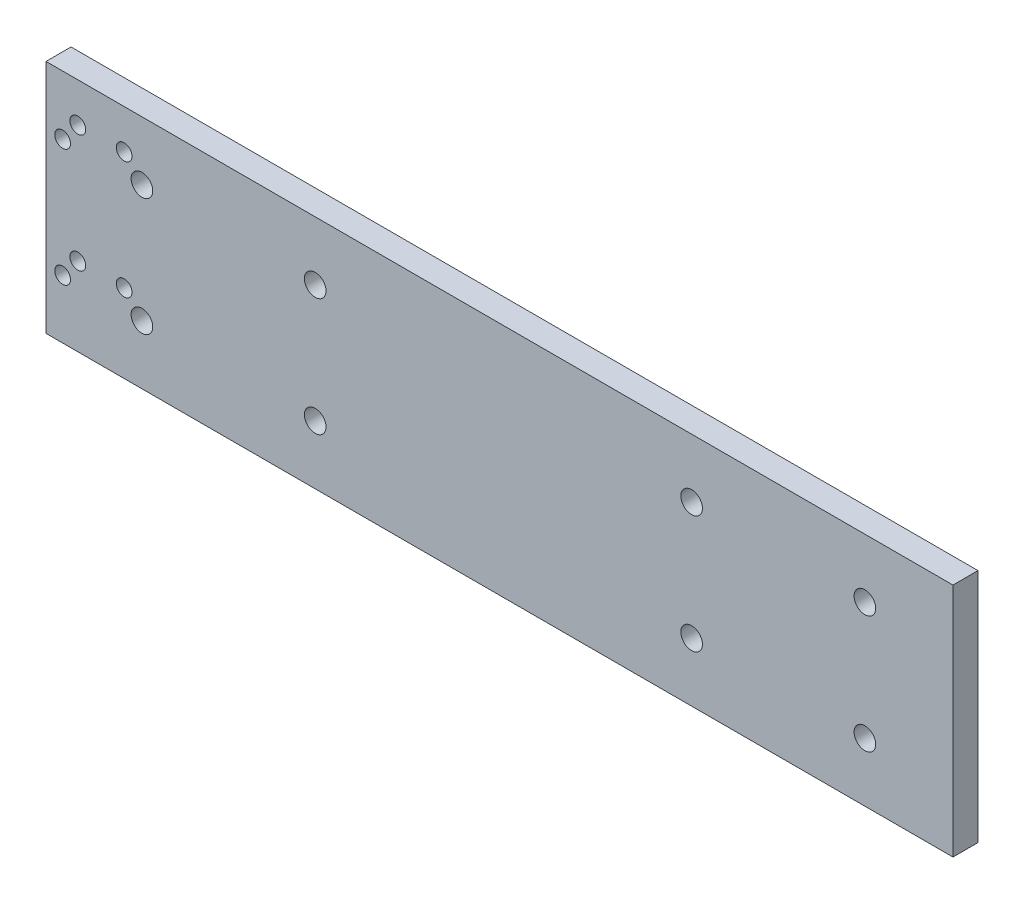
ISO-10303-21;
HEADER;
FILE_DESCRIPTION(('STEP AP214'),'2;1');
FILE_NAME('part.step','',(''),(''),'','','');
FILE_SCHEMA(('AUTOMOTIVE_DESIGN { 1 0 10303 214 1 1 1 1 }'));
ENDSEC;
DATA;
#1=APPLICATION_CONTEXT('core data for automotive mechanical design processes');
#2=APPLICATION_PROTOCOL_DEFINITION('international standard','automotive_design',2000,#1);
#3=PRODUCT_CONTEXT('',#1,'mechanical');
#4=PRODUCT('Part','Part','',(#3));
#5=PRODUCT_RELATED_PRODUCT_CATEGORY('part','',(#4));
#6=PRODUCT_DEFINITION_FORMATION('','',#4);
#7=PRODUCT_DEFINITION_CONTEXT('part definition',#1,'design');
#8=PRODUCT_DEFINITION('design','',#6,#7);
#9=PRODUCT_DEFINITION_SHAPE('','',#8);
#10=(LENGTH_UNIT() NAMED_UNIT(*) SI_UNIT(.MILLI.,.METRE.));
#11=(NAMED_UNIT(*) PLANE_ANGLE_UNIT() SI_UNIT($,.RADIAN.));
#12=(NAMED_UNIT(*) SI_UNIT($,.STERADIAN.) SOLID_ANGLE_UNIT());
#13=UNCERTAINTY_MEASURE_WITH_UNIT(LENGTH_MEASURE(1.E-05),#10,'distance_accuracy_value','');
#14=(GEOMETRIC_REPRESENTATION_CONTEXT(3) GLOBAL_UNCERTAINTY_ASSIGNED_CONTEXT((#13)) GLOBAL_UNIT_ASSIGNED_CONTEXT((#10,
#11,#12)) REPRESENTATION_CONTEXT('',''));
#15=CARTESIAN_POINT('',(0.,0.,0.));
#16=DIRECTION('',(0.,0.,1.));
#17=DIRECTION('',(1.,0.,0.));
#18=AXIS2_PLACEMENT_3D('',#15,#16,#17);
#19=CARTESIAN_POINT('',(34.544,45.72,1.6194));
#20=DIRECTION('',(0.,-1.,0.));
#21=DIRECTION('',(0.,0.,-1.));
#22=AXIS2_PLACEMENT_3D('',#19,#20,#21);
#23=PLANE('',#22);
#24=DIRECTION('',(-1.,0.,0.));
#25=VECTOR('',#24,1.);
#26=CARTESIAN_POINT('',(34.544,45.72,0.));
#27=LINE('',#26,#25);
#28=CARTESIAN_POINT('',(93.218,45.72,0.));
#29=VERTEX_POINT('',#28);
#30=CARTESIAN_POINT('',(34.544,45.72,0.));
#31=VERTEX_POINT('',#30);
#32=EDGE_CURVE('E104',#29,#31,#27,.T.);
#33=ORIENTED_EDGE('',*,*,#32,.T.);
#34=DIRECTION('',(0.,0.,-1.));
#35=VECTOR('',#34,1.);
#36=CARTESIAN_POINT('',(34.544,45.72,1.6194));
#37=LINE('',#36,#35);
#38=CARTESIAN_POINT('',(34.544,45.72,1.6194));
#39=VERTEX_POINT('',#38);
#40=EDGE_CURVE('E11',#39,#31,#37,.T.);
#41=ORIENTED_EDGE('',*,*,#40,.F.);
#42=DIRECTION('',(-1.,0.,0.));
#43=VECTOR('',#42,1.);
#44=CARTESIAN_POINT('',(34.544,45.72,1.6194));
#45=LINE('',#44,#43);
#46=CARTESIAN_POINT('',(93.218,45.72,1.6194));
#47=VERTEX_POINT('',#46);
#48=EDGE_CURVE('E92',#47,#39,#45,.T.);
#49=ORIENTED_EDGE('',*,*,#48,.F.);
#50=DIRECTION('',(0.,0.,-1.));
#51=VECTOR('',#50,1.);
#52=CARTESIAN_POINT('',(93.218,45.72,1.6194));
#53=LINE('',#52,#51);
#54=EDGE_CURVE('E100',#47,#29,#53,.T.);
#55=ORIENTED_EDGE('',*,*,#54,.T.);
#56=EDGE_LOOP('',(#33,#41,#49,#55));
#57=FACE_BOUND('',#56,.T.);
#58=ADVANCED_FACE('F41',(#57),#23,.F.);
#59=CARTESIAN_POINT('',(34.544,30.48,1.6194));
#60=DIRECTION('',(1.,0.,0.));
#61=DIRECTION('',(0.,0.,-1.));
#62=AXIS2_PLACEMENT_3D('',#59,#60,#61);
#63=PLANE('',#62);
#64=DIRECTION('',(0.,-1.,0.));
#65=VECTOR('',#64,1.);
#66=CARTESIAN_POINT('',(34.544,30.48,0.));
#67=LINE('',#66,#65);
#68=CARTESIAN_POINT('',(34.544,30.48,0.));
#69=VERTEX_POINT('',#68);
#70=EDGE_CURVE('E96',#31,#69,#67,.T.);
#71=ORIENTED_EDGE('',*,*,#70,.T.);
#72=DIRECTION('',(0.,0.,-1.));
#73=VECTOR('',#72,1.);
#74=CARTESIAN_POINT('',(34.544,30.48,1.6194));
#75=LINE('',#74,#73);
#76=CARTESIAN_POINT('',(34.544,30.48,1.6194));
#77=VERTEX_POINT('',#76);
#78=EDGE_CURVE('E49',#77,#69,#75,.T.);
#79=ORIENTED_EDGE('',*,*,#78,.F.);
#80=DIRECTION('',(0.,-1.,0.));
#81=VECTOR('',#80,1.);
#82=CARTESIAN_POINT('',(34.544,30.48,1.6194));
#83=LINE('',#82,#81);
#84=EDGE_CURVE('E87',#39,#77,#83,.T.);
#85=ORIENTED_EDGE('',*,*,#84,.F.);
#86=ORIENTED_EDGE('',*,*,#40,.T.);
#87=EDGE_LOOP('',(#71,#79,#85,#86));
#88=FACE_BOUND('',#87,.T.);
#89=ADVANCED_FACE('F95',(#88),#63,.F.);
#90=CARTESIAN_POINT('',(93.218,30.48,1.6194));
#91=DIRECTION('',(0.,1.,0.));
#92=DIRECTION('',(0.,0.,1.));
#93=AXIS2_PLACEMENT_3D('',#90,#91,#92);
#94=PLANE('',#93);
#95=DIRECTION('',(1.,0.,0.));
#96=VECTOR('',#95,1.);
#97=CARTESIAN_POINT('',(93.218,30.48,0.));
#98=LINE('',#97,#96);
#99=CARTESIAN_POINT('',(93.218,30.48,0.));
#100=VERTEX_POINT('',#99);
#101=EDGE_CURVE('E74',#69,#100,#98,.T.);
#102=ORIENTED_EDGE('',*,*,#101,.T.);
#103=DIRECTION('',(0.,0.,-1.));
#104=VECTOR('',#103,1.);
#105=CARTESIAN_POINT('',(93.218,30.48,1.6194));
#106=LINE('',#105,#104);
#107=CARTESIAN_POINT('',(93.218,30.48,1.6194));
#108=VERTEX_POINT('',#107);
#109=EDGE_CURVE('E97',#108,#100,#106,.T.);
#110=ORIENTED_EDGE('',*,*,#109,.F.);
#111=DIRECTION('',(1.,0.,0.));
#112=VECTOR('',#111,1.);
#113=CARTESIAN_POINT('',(93.218,30.48,1.6194));
#114=LINE('',#113,#112);
#115=EDGE_CURVE('E90',#77,#108,#114,.T.);
#116=ORIENTED_EDGE('',*,*,#115,.F.);
#117=ORIENTED_EDGE('',*,*,#78,.T.);
#118=EDGE_LOOP('',(#102,#110,#116,#117));
#119=FACE_BOUND('',#118,.T.);
#120=ADVANCED_FACE('F98',(#119),#94,.F.);
#121=CARTESIAN_POINT('',(93.218,45.72,1.6194));
#122=DIRECTION('',(-1.,0.,0.));
#123=DIRECTION('',(0.,0.,1.));
#124=AXIS2_PLACEMENT_3D('',#121,#122,#123);
#125=PLANE('',#124);
#126=DIRECTION('',(0.,1.,0.));
#127=VECTOR('',#126,1.);
#128=CARTESIAN_POINT('',(93.218,45.72,0.));
#129=LINE('',#128,#127);
#130=EDGE_CURVE('E80',#100,#29,#129,.T.);
#131=ORIENTED_EDGE('',*,*,#130,.T.);
#132=ORIENTED_EDGE('',*,*,#54,.F.);
#133=DIRECTION('',(0.,1.,0.));
#134=VECTOR('',#133,1.);
#135=CARTESIAN_POINT('',(93.218,45.72,1.6194));
#136=LINE('',#135,#134);
#137=EDGE_CURVE('E57',#108,#47,#136,.T.);
#138=ORIENTED_EDGE('',*,*,#137,.F.);
#139=ORIENTED_EDGE('',*,*,#109,.T.);
#140=EDGE_LOOP('',(#131,#132,#138,#139));
#141=FACE_BOUND('',#140,.T.);
#142=ADVANCED_FACE('F112',(#141),#125,.F.);
#143=CARTESIAN_POINT('',(0.,0.,1.6194));
#144=DIRECTION('',(0.,0.,-1.));
#145=DIRECTION('',(-1.,0.,0.));
#146=AXIS2_PLACEMENT_3D('',#143,#144,#145);
#147=PLANE('',#146);
#148=CARTESIAN_POINT('',(35.62,34.28,1.61939999999999));
#149=DIRECTION('',(0.,0.,-1.));
#150=DIRECTION('',(-1.,0.,0.));
#151=AXIS2_PLACEMENT_3D('',#148,#149,#150);
#152=CIRCLE('',#151,0.50999999999999);
#153=CARTESIAN_POINT('',(35.11,34.28,1.61939999999999));
#154=VERTEX_POINT('',#153);
#155=EDGE_CURVE('E195',#154,#154,#152,.T.);
#156=ORIENTED_EDGE('',*,*,#155,.T.);
#157=EDGE_LOOP('',(#156));
#158=FACE_BOUND('',#157,.T.);
#159=CARTESIAN_POINT('',(36.6,35.56,1.61939999999999));
#160=DIRECTION('',(0.,0.,-1.));
#161=DIRECTION('',(-1.,0.,0.));
#162=AXIS2_PLACEMENT_3D('',#159,#160,#161);
#163=CIRCLE('',#162,0.50999999999999);
#164=CARTESIAN_POINT('',(36.09,35.56,1.61939999999999));
#165=VERTEX_POINT('',#164);
#166=EDGE_CURVE('E189',#165,#165,#163,.T.);
#167=ORIENTED_EDGE('',*,*,#166,.T.);
#168=EDGE_LOOP('',(#167));
#169=FACE_BOUND('',#168,.T.);
#170=CARTESIAN_POINT('',(39.6,35.56,1.61939999999999));
#171=DIRECTION('',(0.,0.,-1.));
#172=DIRECTION('',(-1.,0.,0.));
#173=AXIS2_PLACEMENT_3D('',#170,#171,#172);
#174=CIRCLE('',#173,0.50999999999999);
#175=CARTESIAN_POINT('',(39.09,35.56,1.61939999999999));
#176=VERTEX_POINT('',#175);
#177=EDGE_CURVE('E183',#176,#176,#174,.T.);
#178=ORIENTED_EDGE('',*,*,#177,.T.);
#179=EDGE_LOOP('',(#178));
#180=FACE_BOUND('',#179,.T.);
#181=CARTESIAN_POINT('',(35.62,41.9,1.61939999999999));
#182=DIRECTION('',(0.,0.,-1.));
#183=DIRECTION('',(-1.,0.,0.));
#184=AXIS2_PLACEMENT_3D('',#181,#182,#183);
#185=CIRCLE('',#184,0.50999999999999);
#186=CARTESIAN_POINT('',(35.11,41.9,1.61939999999999));
#187=VERTEX_POINT('',#186);
#188=EDGE_CURVE('E177',#187,#187,#185,.T.);
#189=ORIENTED_EDGE('',*,*,#188,.T.);
#190=EDGE_LOOP('',(#189));
#191=FACE_BOUND('',#190,.T.);
#192=CARTESIAN_POINT('',(36.6,43.18,1.61939999999999));
#193=DIRECTION('',(0.,0.,-1.));
#194=DIRECTION('',(-1.,0.,0.));
#195=AXIS2_PLACEMENT_3D('',#192,#193,#194);
#196=CIRCLE('',#195,0.50999999999999);
#197=CARTESIAN_POINT('',(36.09,43.18,1.61939999999999));
#198=VERTEX_POINT('',#197);
#199=EDGE_CURVE('E171',#198,#198,#196,.T.);
#200=ORIENTED_EDGE('',*,*,#199,.T.);
#201=EDGE_LOOP('',(#200));
#202=FACE_BOUND('',#201,.T.);
#203=CARTESIAN_POINT('',(39.6,43.18,1.61939999999999));
#204=DIRECTION('',(0.,0.,-1.));
#205=DIRECTION('',(-1.,0.,0.));
#206=AXIS2_PLACEMENT_3D('',#203,#204,#205);
#207=CIRCLE('',#206,0.50999999999999);
#208=CARTESIAN_POINT('',(39.09,43.18,1.61939999999999));
#209=VERTEX_POINT('',#208);
#210=EDGE_CURVE('E165',#209,#209,#207,.T.);
#211=ORIENTED_EDGE('',*,*,#210,.T.);
#212=EDGE_LOOP('',(#211));
#213=FACE_BOUND('',#212,.T.);
#214=CARTESIAN_POINT('',(76.31,41.91,1.61939999999999));
#215=DIRECTION('',(0.,0.,-1.));
#216=DIRECTION('',(-1.,0.,0.));
#217=AXIS2_PLACEMENT_3D('',#214,#215,#216);
#218=CIRCLE('',#217,0.699999999999992);
#219=CARTESIAN_POINT('',(75.61,41.91,1.61939999999999));
#220=VERTEX_POINT('',#219);
#221=EDGE_CURVE('E159',#220,#220,#218,.T.);
#222=ORIENTED_EDGE('',*,*,#221,.T.);
#223=EDGE_LOOP('',(#222));
#224=FACE_BOUND('',#223,.T.);
#225=CARTESIAN_POINT('',(76.31,34.29,1.61939999999999));
#226=DIRECTION('',(0.,0.,-1.));
#227=DIRECTION('',(-1.,0.,0.));
#228=AXIS2_PLACEMENT_3D('',#225,#226,#227);
#229=CIRCLE('',#228,0.699999999999992);
#230=CARTESIAN_POINT('',(75.61,34.29,1.61939999999999));
#231=VERTEX_POINT('',#230);
#232=EDGE_CURVE('E153',#231,#231,#229,.T.);
#233=ORIENTED_EDGE('',*,*,#232,.T.);
#234=EDGE_LOOP('',(#233));
#235=FACE_BOUND('',#234,.T.);
#236=CARTESIAN_POINT('',(40.75,34.29,1.61939999999999));
#237=DIRECTION('',(0.,0.,-1.));
#238=DIRECTION('',(-1.,0.,0.));
#239=AXIS2_PLACEMENT_3D('',#236,#237,#238);
#240=CIRCLE('',#239,0.699999999999985);
#241=CARTESIAN_POINT('',(40.05,34.29,1.61939999999999));
#242=VERTEX_POINT('',#241);
#243=EDGE_CURVE('E147',#242,#242,#240,.T.);
#244=ORIENTED_EDGE('',*,*,#243,.T.);
#245=EDGE_LOOP('',(#244));
#246=FACE_BOUND('',#245,.T.);
#247=CARTESIAN_POINT('',(40.75,41.91,1.61939999999999));
#248=DIRECTION('',(0.,0.,-1.));
#249=DIRECTION('',(-1.,0.,0.));
#250=AXIS2_PLACEMENT_3D('',#247,#248,#249);
#251=CIRCLE('',#250,0.699999999999985);
#252=CARTESIAN_POINT('',(40.05,41.91,1.61939999999999));
#253=VERTEX_POINT('',#252);
#254=EDGE_CURVE('E141',#253,#253,#251,.T.);
#255=ORIENTED_EDGE('',*,*,#254,.T.);
#256=EDGE_LOOP('',(#255));
#257=FACE_BOUND('',#256,.T.);
#258=CARTESIAN_POINT('',(87.52,41.91,1.61939999999999));
#259=DIRECTION('',(0.,0.,-1.));
#260=DIRECTION('',(-1.,0.,0.));
#261=AXIS2_PLACEMENT_3D('',#258,#259,#260);
#262=CIRCLE('',#261,0.699999999999992);
#263=CARTESIAN_POINT('',(86.82,41.91,1.61939999999999));
#264=VERTEX_POINT('',#263);
#265=EDGE_CURVE('E135',#264,#264,#262,.T.);
#266=ORIENTED_EDGE('',*,*,#265,.T.);
#267=EDGE_LOOP('',(#266));
#268=FACE_BOUND('',#267,.T.);
#269=CARTESIAN_POINT('',(87.52,34.29,1.61939999999999));
#270=DIRECTION('',(0.,0.,-1.));
#271=DIRECTION('',(-1.,0.,0.));
#272=AXIS2_PLACEMENT_3D('',#269,#270,#271);
#273=CIRCLE('',#272,0.699999999999992);
#274=CARTESIAN_POINT('',(86.82,34.29,1.61939999999999));
#275=VERTEX_POINT('',#274);
#276=EDGE_CURVE('E129',#275,#275,#273,.T.);
#277=ORIENTED_EDGE('',*,*,#276,.T.);
#278=EDGE_LOOP('',(#277));
#279=FACE_BOUND('',#278,.T.);
#280=CARTESIAN_POINT('',(51.96,34.29,1.61939999999999));
#281=DIRECTION('',(0.,0.,-1.));
#282=DIRECTION('',(-1.,0.,0.));
#283=AXIS2_PLACEMENT_3D('',#280,#281,#282);
#284=CIRCLE('',#283,0.699999999999985);
#285=CARTESIAN_POINT('',(51.26,34.29,1.61939999999999));
#286=VERTEX_POINT('',#285);
#287=EDGE_CURVE('E123',#286,#286,#284,.T.);
#288=ORIENTED_EDGE('',*,*,#287,.T.);
#289=EDGE_LOOP('',(#288));
#290=FACE_BOUND('',#289,.T.);
#291=CARTESIAN_POINT('',(51.96,41.91,1.61939999999999));
#292=DIRECTION('',(0.,0.,-1.));
#293=DIRECTION('',(-1.,0.,0.));
#294=AXIS2_PLACEMENT_3D('',#291,#292,#293);
#295=CIRCLE('',#294,0.699999999999985);
#296=CARTESIAN_POINT('',(51.26,41.91,1.61939999999999));
#297=VERTEX_POINT('',#296);
#298=EDGE_CURVE('E107',#297,#297,#295,.T.);
#299=ORIENTED_EDGE('',*,*,#298,.T.);
#300=EDGE_LOOP('',(#299));
#301=FACE_BOUND('',#300,.T.);
#302=ORIENTED_EDGE('',*,*,#48,.T.);
#303=ORIENTED_EDGE('',*,*,#84,.T.);
#304=ORIENTED_EDGE('',*,*,#115,.T.);
#305=ORIENTED_EDGE('',*,*,#137,.T.);
#306=EDGE_LOOP('',(#302,#303,#304,#305));
#307=FACE_BOUND('',#306,.T.);
#308=ADVANCED_FACE('F88',(#158,#169,#180,#191,#202,#213,#224,#235,#246,#257,#268,#279,#290,#301,
#307),#147,.F.);
#309=CARTESIAN_POINT('',(0.,0.,0.));
#310=DIRECTION('',(0.,0.,-1.));
#311=DIRECTION('',(-1.,0.,0.));
#312=AXIS2_PLACEMENT_3D('',#309,#310,#311);
#313=PLANE('',#312);
#314=CARTESIAN_POINT('',(35.62,34.28,0.));
#315=DIRECTION('',(0.,0.,-1.));
#316=DIRECTION('',(-1.,0.,0.));
#317=AXIS2_PLACEMENT_3D('',#314,#315,#316);
#318=CIRCLE('',#317,0.50999999999999);
#319=CARTESIAN_POINT('',(35.11,34.28,0.));
#320=VERTEX_POINT('',#319);
#321=EDGE_CURVE('E198',#320,#320,#318,.T.);
#322=ORIENTED_EDGE('',*,*,#321,.F.);
#323=EDGE_LOOP('',(#322));
#324=FACE_BOUND('',#323,.T.);
#325=CARTESIAN_POINT('',(36.6,35.56,0.));
#326=DIRECTION('',(0.,0.,-1.));
#327=DIRECTION('',(-1.,0.,0.));
#328=AXIS2_PLACEMENT_3D('',#325,#326,#327);
#329=CIRCLE('',#328,0.50999999999999);
#330=CARTESIAN_POINT('',(36.09,35.56,0.));
#331=VERTEX_POINT('',#330);
#332=EDGE_CURVE('E192',#331,#331,#329,.T.);
#333=ORIENTED_EDGE('',*,*,#332,.F.);
#334=EDGE_LOOP('',(#333));
#335=FACE_BOUND('',#334,.T.);
#336=CARTESIAN_POINT('',(39.6,35.56,0.));
#337=DIRECTION('',(0.,0.,-1.));
#338=DIRECTION('',(-1.,0.,0.));
#339=AXIS2_PLACEMENT_3D('',#336,#337,#338);
#340=CIRCLE('',#339,0.50999999999999);
#341=CARTESIAN_POINT('',(39.09,35.56,0.));
#342=VERTEX_POINT('',#341);
#343=EDGE_CURVE('E186',#342,#342,#340,.T.);
#344=ORIENTED_EDGE('',*,*,#343,.F.);
#345=EDGE_LOOP('',(#344));
#346=FACE_BOUND('',#345,.T.);
#347=CARTESIAN_POINT('',(35.62,41.9,0.));
#348=DIRECTION('',(0.,0.,-1.));
#349=DIRECTION('',(-1.,0.,0.));
#350=AXIS2_PLACEMENT_3D('',#347,#348,#349);
#351=CIRCLE('',#350,0.50999999999999);
#352=CARTESIAN_POINT('',(35.11,41.9,0.));
#353=VERTEX_POINT('',#352);
#354=EDGE_CURVE('E180',#353,#353,#351,.T.);
#355=ORIENTED_EDGE('',*,*,#354,.F.);
#356=EDGE_LOOP('',(#355));
#357=FACE_BOUND('',#356,.T.);
#358=CARTESIAN_POINT('',(36.6,43.18,0.));
#359=DIRECTION('',(0.,0.,-1.));
#360=DIRECTION('',(-1.,0.,0.));
#361=AXIS2_PLACEMENT_3D('',#358,#359,#360);
#362=CIRCLE('',#361,0.50999999999999);
#363=CARTESIAN_POINT('',(36.09,43.18,0.));
#364=VERTEX_POINT('',#363);
#365=EDGE_CURVE('E174',#364,#364,#362,.T.);
#366=ORIENTED_EDGE('',*,*,#365,.F.);
#367=EDGE_LOOP('',(#366));
#368=FACE_BOUND('',#367,.T.);
#369=CARTESIAN_POINT('',(39.6,43.18,0.));
#370=DIRECTION('',(0.,0.,-1.));
#371=DIRECTION('',(-1.,0.,0.));
#372=AXIS2_PLACEMENT_3D('',#369,#370,#371);
#373=CIRCLE('',#372,0.50999999999999);
#374=CARTESIAN_POINT('',(39.09,43.18,0.));
#375=VERTEX_POINT('',#374);
#376=EDGE_CURVE('E168',#375,#375,#373,.T.);
#377=ORIENTED_EDGE('',*,*,#376,.F.);
#378=EDGE_LOOP('',(#377));
#379=FACE_BOUND('',#378,.T.);
#380=CARTESIAN_POINT('',(76.31,41.91,0.));
#381=DIRECTION('',(0.,0.,-1.));
#382=DIRECTION('',(-1.,0.,0.));
#383=AXIS2_PLACEMENT_3D('',#380,#381,#382);
#384=CIRCLE('',#383,0.699999999999992);
#385=CARTESIAN_POINT('',(75.61,41.91,0.));
#386=VERTEX_POINT('',#385);
#387=EDGE_CURVE('E162',#386,#386,#384,.T.);
#388=ORIENTED_EDGE('',*,*,#387,.F.);
#389=EDGE_LOOP('',(#388));
#390=FACE_BOUND('',#389,.T.);
#391=CARTESIAN_POINT('',(76.31,34.29,0.));
#392=DIRECTION('',(0.,0.,-1.));
#393=DIRECTION('',(-1.,0.,0.));
#394=AXIS2_PLACEMENT_3D('',#391,#392,#393);
#395=CIRCLE('',#394,0.699999999999992);
#396=CARTESIAN_POINT('',(75.61,34.29,0.));
#397=VERTEX_POINT('',#396);
#398=EDGE_CURVE('E156',#397,#397,#395,.T.);
#399=ORIENTED_EDGE('',*,*,#398,.F.);
#400=EDGE_LOOP('',(#399));
#401=FACE_BOUND('',#400,.T.);
#402=CARTESIAN_POINT('',(40.75,34.29,0.));
#403=DIRECTION('',(0.,0.,-1.));
#404=DIRECTION('',(-1.,0.,0.));
#405=AXIS2_PLACEMENT_3D('',#402,#403,#404);
#406=CIRCLE('',#405,0.699999999999985);
#407=CARTESIAN_POINT('',(40.05,34.29,0.));
#408=VERTEX_POINT('',#407);
#409=EDGE_CURVE('E150',#408,#408,#406,.T.);
#410=ORIENTED_EDGE('',*,*,#409,.F.);
#411=EDGE_LOOP('',(#410));
#412=FACE_BOUND('',#411,.T.);
#413=CARTESIAN_POINT('',(40.75,41.91,0.));
#414=DIRECTION('',(0.,0.,-1.));
#415=DIRECTION('',(-1.,0.,0.));
#416=AXIS2_PLACEMENT_3D('',#413,#414,#415);
#417=CIRCLE('',#416,0.699999999999985);
#418=CARTESIAN_POINT('',(40.05,41.91,0.));
#419=VERTEX_POINT('',#418);
#420=EDGE_CURVE('E144',#419,#419,#417,.T.);
#421=ORIENTED_EDGE('',*,*,#420,.F.);
#422=EDGE_LOOP('',(#421));
#423=FACE_BOUND('',#422,.T.);
#424=CARTESIAN_POINT('',(87.52,41.91,0.));
#425=DIRECTION('',(0.,0.,-1.));
#426=DIRECTION('',(-1.,0.,0.));
#427=AXIS2_PLACEMENT_3D('',#424,#425,#426);
#428=CIRCLE('',#427,0.699999999999992);
#429=CARTESIAN_POINT('',(86.82,41.91,0.));
#430=VERTEX_POINT('',#429);
#431=EDGE_CURVE('E138',#430,#430,#428,.T.);
#432=ORIENTED_EDGE('',*,*,#431,.F.);
#433=EDGE_LOOP('',(#432));
#434=FACE_BOUND('',#433,.T.);
#435=CARTESIAN_POINT('',(87.52,34.29,0.));
#436=DIRECTION('',(0.,0.,-1.));
#437=DIRECTION('',(-1.,0.,0.));
#438=AXIS2_PLACEMENT_3D('',#435,#436,#437);
#439=CIRCLE('',#438,0.699999999999992);
#440=CARTESIAN_POINT('',(86.82,34.29,0.));
#441=VERTEX_POINT('',#440);
#442=EDGE_CURVE('E132',#441,#441,#439,.T.);
#443=ORIENTED_EDGE('',*,*,#442,.F.);
#444=EDGE_LOOP('',(#443));
#445=FACE_BOUND('',#444,.T.);
#446=CARTESIAN_POINT('',(51.96,34.29,0.));
#447=DIRECTION('',(0.,0.,-1.));
#448=DIRECTION('',(-1.,0.,0.));
#449=AXIS2_PLACEMENT_3D('',#446,#447,#448);
#450=CIRCLE('',#449,0.699999999999985);
#451=CARTESIAN_POINT('',(51.26,34.29,0.));
#452=VERTEX_POINT('',#451);
#453=EDGE_CURVE('E126',#452,#452,#450,.T.);
#454=ORIENTED_EDGE('',*,*,#453,.F.);
#455=EDGE_LOOP('',(#454));
#456=FACE_BOUND('',#455,.T.);
#457=CARTESIAN_POINT('',(51.96,41.91,0.));
#458=DIRECTION('',(0.,0.,-1.));
#459=DIRECTION('',(-1.,0.,0.));
#460=AXIS2_PLACEMENT_3D('',#457,#458,#459);
#461=CIRCLE('',#460,0.699999999999985);
#462=CARTESIAN_POINT('',(51.26,41.91,0.));
#463=VERTEX_POINT('',#462);
#464=EDGE_CURVE('E120',#463,#463,#461,.T.);
#465=ORIENTED_EDGE('',*,*,#464,.F.);
#466=EDGE_LOOP('',(#465));
#467=FACE_BOUND('',#466,.T.);
#468=ORIENTED_EDGE('',*,*,#32,.F.);
#469=ORIENTED_EDGE('',*,*,#130,.F.);
#470=ORIENTED_EDGE('',*,*,#101,.F.);
#471=ORIENTED_EDGE('',*,*,#70,.F.);
#472=EDGE_LOOP('',(#468,#469,#470,#471));
#473=FACE_BOUND('',#472,.T.);
#474=ADVANCED_FACE('F115',(#324,#335,#346,#357,#368,#379,#390,#401,#412,#423,#434,#445,#456,
#467,#473),#313,.T.);
#475=CARTESIAN_POINT('',(51.96,41.91,0.));
#476=DIRECTION('',(0.,0.,-1.));
#477=DIRECTION('',(-1.,0.,0.));
#478=AXIS2_PLACEMENT_3D('',#475,#476,#477);
#479=CYLINDRICAL_SURFACE('',#478,0.699999999999985);
#480=ORIENTED_EDGE('',*,*,#298,.F.);
#481=EDGE_LOOP('',(#480));
#482=FACE_BOUND('',#481,.T.);
#483=ORIENTED_EDGE('',*,*,#464,.T.);
#484=EDGE_LOOP('',(#483));
#485=FACE_BOUND('',#484,.T.);
#486=ADVANCED_FACE('F206',(#482,#485),#479,.F.);
#487=CARTESIAN_POINT('',(51.96,34.29,0.));
#488=DIRECTION('',(0.,0.,-1.));
#489=DIRECTION('',(-1.,0.,0.));
#490=AXIS2_PLACEMENT_3D('',#487,#488,#489);
#491=CYLINDRICAL_SURFACE('',#490,0.699999999999985);
#492=ORIENTED_EDGE('',*,*,#287,.F.);
#493=EDGE_LOOP('',(#492));
#494=FACE_BOUND('',#493,.T.);
#495=ORIENTED_EDGE('',*,*,#453,.T.);
#496=EDGE_LOOP('',(#495));
#497=FACE_BOUND('',#496,.T.);
#498=ADVANCED_FACE('F235',(#494,#497),#491,.F.);
#499=CARTESIAN_POINT('',(87.52,34.29,0.));
#500=DIRECTION('',(0.,0.,-1.));
#501=DIRECTION('',(-1.,0.,0.));
#502=AXIS2_PLACEMENT_3D('',#499,#500,#501);
#503=CYLINDRICAL_SURFACE('',#502,0.699999999999992);
#504=ORIENTED_EDGE('',*,*,#276,.F.);
#505=EDGE_LOOP('',(#504));
#506=FACE_BOUND('',#505,.T.);
#507=ORIENTED_EDGE('',*,*,#442,.T.);
#508=EDGE_LOOP('',(#507));
#509=FACE_BOUND('',#508,.T.);
#510=ADVANCED_FACE('F241',(#506,#509),#503,.F.);
#511=CARTESIAN_POINT('',(87.52,41.91,0.));
#512=DIRECTION('',(0.,0.,-1.));
#513=DIRECTION('',(-1.,0.,0.));
#514=AXIS2_PLACEMENT_3D('',#511,#512,#513);
#515=CYLINDRICAL_SURFACE('',#514,0.699999999999992);
#516=ORIENTED_EDGE('',*,*,#265,.F.);
#517=EDGE_LOOP('',(#516));
#518=FACE_BOUND('',#517,.T.);
#519=ORIENTED_EDGE('',*,*,#431,.T.);
#520=EDGE_LOOP('',(#519));
#521=FACE_BOUND('',#520,.T.);
#522=ADVANCED_FACE('F290',(#518,#521),#515,.F.);
#523=CARTESIAN_POINT('',(40.75,41.91,0.));
#524=DIRECTION('',(0.,0.,-1.));
#525=DIRECTION('',(-1.,0.,0.));
#526=AXIS2_PLACEMENT_3D('',#523,#524,#525);
#527=CYLINDRICAL_SURFACE('',#526,0.699999999999985);
#528=ORIENTED_EDGE('',*,*,#254,.F.);
#529=EDGE_LOOP('',(#528));
#530=FACE_BOUND('',#529,.T.);
#531=ORIENTED_EDGE('',*,*,#420,.T.);
#532=EDGE_LOOP('',(#531));
#533=FACE_BOUND('',#532,.T.);
#534=ADVANCED_FACE('F295',(#530,#533),#527,.F.);
#535=CARTESIAN_POINT('',(40.75,34.29,0.));
#536=DIRECTION('',(0.,0.,-1.));
#537=DIRECTION('',(-1.,0.,0.));
#538=AXIS2_PLACEMENT_3D('',#535,#536,#537);
#539=CYLINDRICAL_SURFACE('',#538,0.699999999999985);
#540=ORIENTED_EDGE('',*,*,#243,.F.);
#541=EDGE_LOOP('',(#540));
#542=FACE_BOUND('',#541,.T.);
#543=ORIENTED_EDGE('',*,*,#409,.T.);
#544=EDGE_LOOP('',(#543));
#545=FACE_BOUND('',#544,.T.);
#546=ADVANCED_FACE('F301',(#542,#545),#539,.F.);
#547=CARTESIAN_POINT('',(76.31,34.29,0.));
#548=DIRECTION('',(0.,0.,-1.));
#549=DIRECTION('',(-1.,0.,0.));
#550=AXIS2_PLACEMENT_3D('',#547,#548,#549);
#551=CYLINDRICAL_SURFACE('',#550,0.699999999999992);
#552=ORIENTED_EDGE('',*,*,#232,.F.);
#553=EDGE_LOOP('',(#552));
#554=FACE_BOUND('',#553,.T.);
#555=ORIENTED_EDGE('',*,*,#398,.T.);
#556=EDGE_LOOP('',(#555));
#557=FACE_BOUND('',#556,.T.);
#558=ADVANCED_FACE('F305',(#554,#557),#551,.F.);
#559=CARTESIAN_POINT('',(76.31,41.91,0.));
#560=DIRECTION('',(0.,0.,-1.));
#561=DIRECTION('',(-1.,0.,0.));
#562=AXIS2_PLACEMENT_3D('',#559,#560,#561);
#563=CYLINDRICAL_SURFACE('',#562,0.699999999999992);
#564=ORIENTED_EDGE('',*,*,#221,.F.);
#565=EDGE_LOOP('',(#564));
#566=FACE_BOUND('',#565,.T.);
#567=ORIENTED_EDGE('',*,*,#387,.T.);
#568=EDGE_LOOP('',(#567));
#569=FACE_BOUND('',#568,.T.);
#570=ADVANCED_FACE('F309',(#566,#569),#563,.F.);
#571=CARTESIAN_POINT('',(39.6,43.18,0.));
#572=DIRECTION('',(0.,0.,-1.));
#573=DIRECTION('',(-1.,0.,0.));
#574=AXIS2_PLACEMENT_3D('',#571,#572,#573);
#575=CYLINDRICAL_SURFACE('',#574,0.50999999999999);
#576=ORIENTED_EDGE('',*,*,#210,.F.);
#577=EDGE_LOOP('',(#576));
#578=FACE_BOUND('',#577,.T.);
#579=ORIENTED_EDGE('',*,*,#376,.T.);
#580=EDGE_LOOP('',(#579));
#581=FACE_BOUND('',#580,.T.);
#582=ADVANCED_FACE('F313',(#578,#581),#575,.F.);
#583=CARTESIAN_POINT('',(36.6,43.18,0.));
#584=DIRECTION('',(0.,0.,-1.));
#585=DIRECTION('',(-1.,0.,0.));
#586=AXIS2_PLACEMENT_3D('',#583,#584,#585);
#587=CYLINDRICAL_SURFACE('',#586,0.50999999999999);
#588=ORIENTED_EDGE('',*,*,#199,.F.);
#589=EDGE_LOOP('',(#588));
#590=FACE_BOUND('',#589,.T.);
#591=ORIENTED_EDGE('',*,*,#365,.T.);
#592=EDGE_LOOP('',(#591));
#593=FACE_BOUND('',#592,.T.);
#594=ADVANCED_FACE('F317',(#590,#593),#587,.F.);
#595=CARTESIAN_POINT('',(35.62,41.9,0.));
#596=DIRECTION('',(0.,0.,-1.));
#597=DIRECTION('',(-1.,0.,0.));
#598=AXIS2_PLACEMENT_3D('',#595,#596,#597);
#599=CYLINDRICAL_SURFACE('',#598,0.50999999999999);
#600=ORIENTED_EDGE('',*,*,#188,.F.);
#601=EDGE_LOOP('',(#600));
#602=FACE_BOUND('',#601,.T.);
#603=ORIENTED_EDGE('',*,*,#354,.T.);
#604=EDGE_LOOP('',(#603));
#605=FACE_BOUND('',#604,.T.);
#606=ADVANCED_FACE('F321',(#602,#605),#599,.F.);
#607=CARTESIAN_POINT('',(39.6,35.56,0.));
#608=DIRECTION('',(0.,0.,-1.));
#609=DIRECTION('',(-1.,0.,0.));
#610=AXIS2_PLACEMENT_3D('',#607,#608,#609);
#611=CYLINDRICAL_SURFACE('',#610,0.50999999999999);
#612=ORIENTED_EDGE('',*,*,#177,.F.);
#613=EDGE_LOOP('',(#612));
#614=FACE_BOUND('',#613,.T.);
#615=ORIENTED_EDGE('',*,*,#343,.T.);
#616=EDGE_LOOP('',(#615));
#617=FACE_BOUND('',#616,.T.);
#618=ADVANCED_FACE('F325',(#614,#617),#611,.F.);
#619=CARTESIAN_POINT('',(36.6,35.56,0.));
#620=DIRECTION('',(0.,0.,-1.));
#621=DIRECTION('',(-1.,0.,0.));
#622=AXIS2_PLACEMENT_3D('',#619,#620,#621);
#623=CYLINDRICAL_SURFACE('',#622,0.50999999999999);
#624=ORIENTED_EDGE('',*,*,#166,.F.);
#625=EDGE_LOOP('',(#624));
#626=FACE_BOUND('',#625,.T.);
#627=ORIENTED_EDGE('',*,*,#332,.T.);
#628=EDGE_LOOP('',(#627));
#629=FACE_BOUND('',#628,.T.);
#630=ADVANCED_FACE('F329',(#626,#629),#623,.F.);
#631=CARTESIAN_POINT('',(35.62,34.28,0.));
#632=DIRECTION('',(0.,0.,-1.));
#633=DIRECTION('',(-1.,0.,0.));
#634=AXIS2_PLACEMENT_3D('',#631,#632,#633);
#635=CYLINDRICAL_SURFACE('',#634,0.50999999999999);
#636=ORIENTED_EDGE('',*,*,#155,.F.);
#637=EDGE_LOOP('',(#636));
#638=FACE_BOUND('',#637,.T.);
#639=ORIENTED_EDGE('',*,*,#321,.T.);
#640=EDGE_LOOP('',(#639));
#641=FACE_BOUND('',#640,.T.);
#642=ADVANCED_FACE('F202',(#638,#641),#635,.F.);
#643=CLOSED_SHELL('',(#58,#89,#120,#142,#308,#474,#486,#498,#510,#522,#534,#546,#558,#570,#582,
#594,#606,#618,#630,#642));
#644=MANIFOLD_SOLID_BREP('B2',#643);
#645=ADVANCED_BREP_SHAPE_REPRESENTATION('',(#18,#644),#14);
#646=SHAPE_DEFINITION_REPRESENTATION(#9,#645);
ENDSEC;
END-ISO-10303-21;
